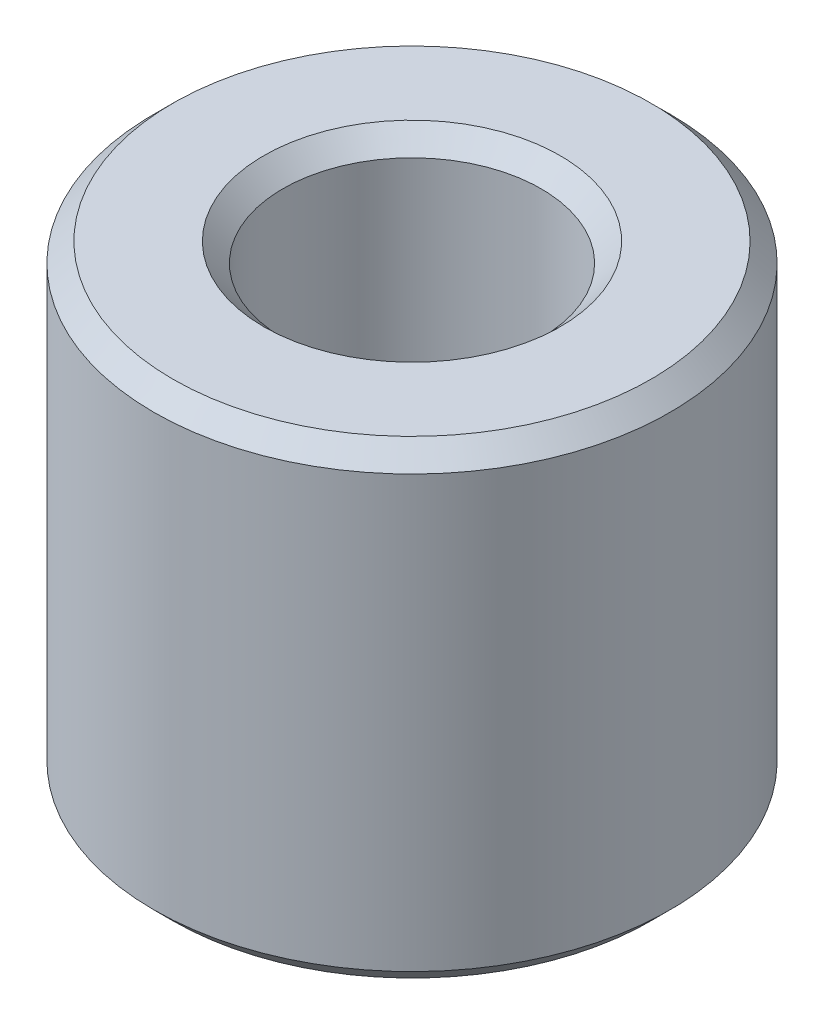
ISO-10303-21;
HEADER;
FILE_DESCRIPTION(('STEP AP214'),'2;1');
FILE_NAME('part.step','',(''),(''),'','','');
FILE_SCHEMA(('AUTOMOTIVE_DESIGN { 1 0 10303 214 1 1 1 1 }'));
ENDSEC;
DATA;
#1=APPLICATION_CONTEXT('core data for automotive mechanical design processes');
#2=APPLICATION_PROTOCOL_DEFINITION('international standard','automotive_design',2000,#1);
#3=PRODUCT_CONTEXT('',#1,'mechanical');
#4=PRODUCT('Part','Part','',(#3));
#5=PRODUCT_RELATED_PRODUCT_CATEGORY('part','',(#4));
#6=PRODUCT_DEFINITION_FORMATION('','',#4);
#7=PRODUCT_DEFINITION_CONTEXT('part definition',#1,'design');
#8=PRODUCT_DEFINITION('design','',#6,#7);
#9=PRODUCT_DEFINITION_SHAPE('','',#8);
#10=(LENGTH_UNIT() NAMED_UNIT(*) SI_UNIT(.MILLI.,.METRE.));
#11=(NAMED_UNIT(*) PLANE_ANGLE_UNIT() SI_UNIT($,.RADIAN.));
#12=(NAMED_UNIT(*) SI_UNIT($,.STERADIAN.) SOLID_ANGLE_UNIT());
#13=UNCERTAINTY_MEASURE_WITH_UNIT(LENGTH_MEASURE(1.E-05),#10,'distance_accuracy_value','');
#14=(GEOMETRIC_REPRESENTATION_CONTEXT(3) GLOBAL_UNCERTAINTY_ASSIGNED_CONTEXT((#13)) GLOBAL_UNIT_ASSIGNED_CONTEXT((#10,
#11,#12)) REPRESENTATION_CONTEXT('',''));
#15=CARTESIAN_POINT('',(0.,0.,0.));
#16=DIRECTION('',(0.,0.,1.));
#17=DIRECTION('',(1.,0.,0.));
#18=AXIS2_PLACEMENT_3D('',#15,#16,#17);
#19=CARTESIAN_POINT('',(0.,68.1328293369416,0.));
#20=DIRECTION('',(0.,-1.,0.));
#21=DIRECTION('',(0.,0.,-1.));
#22=AXIS2_PLACEMENT_3D('',#19,#20,#21);
#23=CYLINDRICAL_SURFACE('',#22,37.5);
#24=CARTESIAN_POINT('',(0.,2.77538327487907,0.));
#25=DIRECTION('',(0.,1.,0.));
#26=DIRECTION('',(0.,0.,1.));
#27=AXIS2_PLACEMENT_3D('',#24,#25,#26);
#28=CIRCLE('',#27,37.5);
#29=CARTESIAN_POINT('',(0.,2.77538327487907,37.5));
#30=VERTEX_POINT('',#29);
#31=EDGE_CURVE('E10',#30,#30,#28,.T.);
#32=ORIENTED_EDGE('',*,*,#31,.T.);
#33=EDGE_LOOP('',(#32));
#34=FACE_BOUND('',#33,.T.);
#35=CARTESIAN_POINT('',(0.,65.3595901115712,0.));
#36=DIRECTION('',(0.,1.,0.));
#37=DIRECTION('',(0.,0.,1.));
#38=AXIS2_PLACEMENT_3D('',#35,#36,#37);
#39=CIRCLE('',#38,37.5);
#40=CARTESIAN_POINT('',(0.,65.3595901115712,37.5));
#41=VERTEX_POINT('',#40);
#42=EDGE_CURVE('E50',#41,#41,#39,.F.);
#43=ORIENTED_EDGE('',*,*,#42,.T.);
#44=EDGE_LOOP('',(#43));
#45=FACE_BOUND('',#44,.T.);
#46=ADVANCED_FACE('F39',(#34,#45),#23,.T.);
#47=CARTESIAN_POINT('',(0.,68.1328293369416,0.));
#48=DIRECTION('',(0.,1.,0.));
#49=DIRECTION('',(0.,0.,1.));
#50=AXIS2_PLACEMENT_3D('',#47,#48,#49);
#51=PLANE('',#50);
#52=CARTESIAN_POINT('',(0.,68.1328293369416,0.));
#53=DIRECTION('',(0.,1.,0.));
#54=DIRECTION('',(0.,0.,1.));
#55=AXIS2_PLACEMENT_3D('',#52,#53,#54);
#56=CIRCLE('',#55,21.5323604486395);
#57=CARTESIAN_POINT('',(0.,68.1328293369416,21.5323604486395));
#58=VERTEX_POINT('',#57);
#59=EDGE_CURVE('E58',#58,#58,#56,.F.);
#60=ORIENTED_EDGE('',*,*,#59,.T.);
#61=EDGE_LOOP('',(#60));
#62=FACE_BOUND('',#61,.T.);
#63=CARTESIAN_POINT('',(0.,68.1328293369416,0.));
#64=DIRECTION('',(0.,1.,0.));
#65=DIRECTION('',(0.,0.,1.));
#66=AXIS2_PLACEMENT_3D('',#63,#64,#65);
#67=CIRCLE('',#66,34.7246167251209);
#68=CARTESIAN_POINT('',(0.,68.1328293369416,34.7246167251209));
#69=VERTEX_POINT('',#68);
#70=EDGE_CURVE('E61',#69,#69,#67,.T.);
#71=ORIENTED_EDGE('',*,*,#70,.T.);
#72=EDGE_LOOP('',(#71));
#73=FACE_BOUND('',#72,.T.);
#74=ADVANCED_FACE('F88',(#62,#73),#51,.T.);
#75=CARTESIAN_POINT('',(0.,0.,0.));
#76=DIRECTION('',(0.,1.,0.));
#77=DIRECTION('',(0.,0.,1.));
#78=AXIS2_PLACEMENT_3D('',#75,#76,#77);
#79=PLANE('',#78);
#80=CARTESIAN_POINT('',(0.,0.,0.));
#81=DIRECTION('',(0.,1.,0.));
#82=DIRECTION('',(0.,0.,1.));
#83=AXIS2_PLACEMENT_3D('',#80,#81,#82);
#84=CIRCLE('',#83,21.5345044981482);
#85=CARTESIAN_POINT('',(0.,0.,21.5345044981482));
#86=VERTEX_POINT('',#85);
#87=EDGE_CURVE('E51',#86,#86,#84,.T.);
#88=ORIENTED_EDGE('',*,*,#87,.T.);
#89=EDGE_LOOP('',(#88));
#90=FACE_BOUND('',#89,.T.);
#91=CARTESIAN_POINT('',(0.,0.,0.));
#92=DIRECTION('',(0.,1.,0.));
#93=DIRECTION('',(0.,0.,1.));
#94=AXIS2_PLACEMENT_3D('',#91,#92,#93);
#95=CIRCLE('',#94,34.7267607746297);
#96=CARTESIAN_POINT('',(0.,0.,34.7267607746297));
#97=VERTEX_POINT('',#96);
#98=EDGE_CURVE('E54',#97,#97,#95,.F.);
#99=ORIENTED_EDGE('',*,*,#98,.T.);
#100=EDGE_LOOP('',(#99));
#101=FACE_BOUND('',#100,.T.);
#102=ADVANCED_FACE('F83',(#90,#101),#79,.F.);
#103=CARTESIAN_POINT('',(0.,68.1328293369416,0.));
#104=DIRECTION('',(0.,-1.,0.));
#105=DIRECTION('',(0.,0.,-1.));
#106=AXIS2_PLACEMENT_3D('',#103,#104,#105);
#107=CYLINDRICAL_SURFACE('',#106,18.7591212232692);
#108=CARTESIAN_POINT('',(0.,65.3574460620625,0.));
#109=DIRECTION('',(0.,1.,0.));
#110=DIRECTION('',(0.,0.,1.));
#111=AXIS2_PLACEMENT_3D('',#108,#109,#110);
#112=CIRCLE('',#111,18.7591212232692);
#113=CARTESIAN_POINT('',(0.,65.3574460620625,18.7591212232692));
#114=VERTEX_POINT('',#113);
#115=EDGE_CURVE('E67',#114,#114,#112,.T.);
#116=ORIENTED_EDGE('',*,*,#115,.T.);
#117=EDGE_LOOP('',(#116));
#118=FACE_BOUND('',#117,.T.);
#119=CARTESIAN_POINT('',(0.,2.77323922537032,0.));
#120=DIRECTION('',(0.,1.,0.));
#121=DIRECTION('',(0.,0.,1.));
#122=AXIS2_PLACEMENT_3D('',#119,#120,#121);
#123=CIRCLE('',#122,18.7591212232692);
#124=CARTESIAN_POINT('',(0.,2.77323922537032,18.7591212232692));
#125=VERTEX_POINT('',#124);
#126=EDGE_CURVE('E69',#125,#125,#123,.F.);
#127=ORIENTED_EDGE('',*,*,#126,.T.);
#128=EDGE_LOOP('',(#127));
#129=FACE_BOUND('',#128,.T.);
#130=ADVANCED_FACE('F71',(#118,#129),#107,.F.);
#131=CARTESIAN_POINT('',(0.,65.3574460620625,0.));
#132=DIRECTION('',(0.,1.,0.));
#133=DIRECTION('',(0.,0.,1.));
#134=AXIS2_PLACEMENT_3D('',#131,#132,#133);
#135=CONICAL_SURFACE('',#134,18.7591212232692,0.785011752283351);
#136=ORIENTED_EDGE('',*,*,#59,.F.);
#137=EDGE_LOOP('',(#136));
#138=FACE_BOUND('',#137,.T.);
#139=ORIENTED_EDGE('',*,*,#115,.F.);
#140=EDGE_LOOP('',(#139));
#141=FACE_BOUND('',#140,.T.);
#142=ADVANCED_FACE('F77',(#138,#141),#135,.F.);
#143=CARTESIAN_POINT('',(0.,0.,0.));
#144=DIRECTION('',(0.,-1.,0.));
#145=DIRECTION('',(0.,0.,-1.));
#146=AXIS2_PLACEMENT_3D('',#143,#144,#145);
#147=CONICAL_SURFACE('',#146,21.5345044981482,0.785784574511544);
#148=ORIENTED_EDGE('',*,*,#126,.F.);
#149=EDGE_LOOP('',(#148));
#150=FACE_BOUND('',#149,.T.);
#151=ORIENTED_EDGE('',*,*,#87,.F.);
#152=EDGE_LOOP('',(#151));
#153=FACE_BOUND('',#152,.T.);
#154=ADVANCED_FACE('F73',(#150,#153),#147,.F.);
#155=CARTESIAN_POINT('',(0.,2.77538327487907,0.));
#156=DIRECTION('',(0.,1.,0.));
#157=DIRECTION('',(0.,0.,1.));
#158=AXIS2_PLACEMENT_3D('',#155,#156,#157);
#159=CONICAL_SURFACE('',#158,37.5,0.785011752283353);
#160=ORIENTED_EDGE('',*,*,#98,.F.);
#161=EDGE_LOOP('',(#160));
#162=FACE_BOUND('',#161,.T.);
#163=ORIENTED_EDGE('',*,*,#31,.F.);
#164=EDGE_LOOP('',(#163));
#165=FACE_BOUND('',#164,.T.);
#166=ADVANCED_FACE('F76',(#162,#165),#159,.T.);
#167=CARTESIAN_POINT('',(0.,68.1328293369416,0.));
#168=DIRECTION('',(0.,-1.,0.));
#169=DIRECTION('',(0.,0.,-1.));
#170=AXIS2_PLACEMENT_3D('',#167,#168,#169);
#171=CONICAL_SURFACE('',#170,34.7246167251209,0.785784574511548);
#172=ORIENTED_EDGE('',*,*,#42,.F.);
#173=EDGE_LOOP('',(#172));
#174=FACE_BOUND('',#173,.T.);
#175=ORIENTED_EDGE('',*,*,#70,.F.);
#176=EDGE_LOOP('',(#175));
#177=FACE_BOUND('',#176,.T.);
#178=ADVANCED_FACE('F45',(#174,#177),#171,.T.);
#179=CLOSED_SHELL('',(#46,#74,#102,#130,#142,#154,#166,#178));
#180=MANIFOLD_SOLID_BREP('B2',#179);
#181=ADVANCED_BREP_SHAPE_REPRESENTATION('',(#18,#180),#14);
#182=SHAPE_DEFINITION_REPRESENTATION(#9,#181);
ENDSEC;
END-ISO-10303-21;
